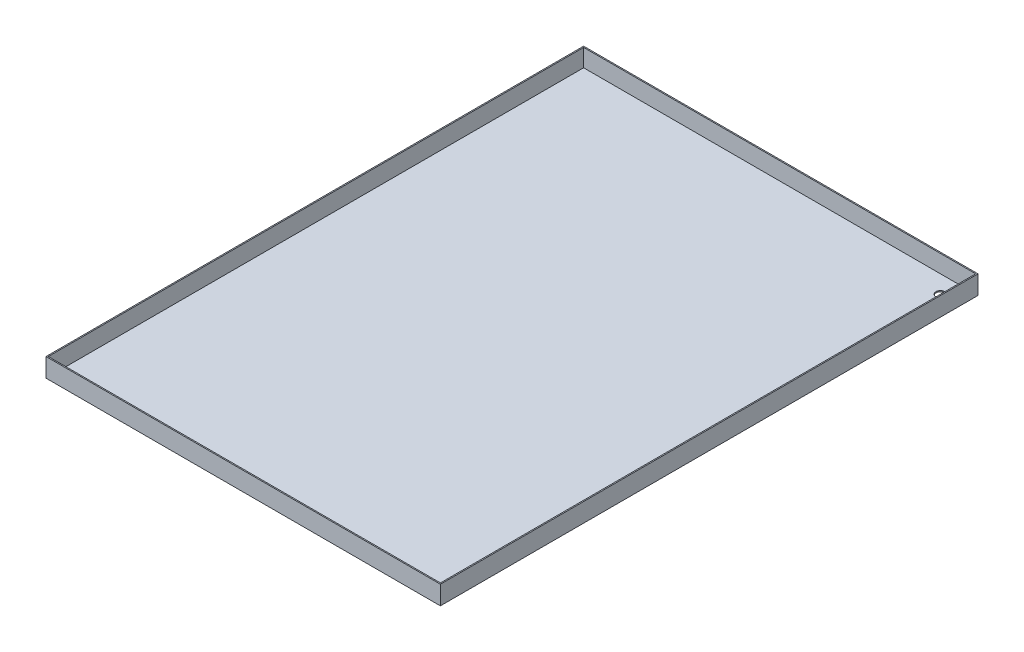
ISO-10303-21;
HEADER;
FILE_DESCRIPTION(('STEP AP214'),'2;1');
FILE_NAME('part.step','',(''),(''),'','','');
FILE_SCHEMA(('AUTOMOTIVE_DESIGN { 1 0 10303 214 1 1 1 1 }'));
ENDSEC;
DATA;
#1=APPLICATION_CONTEXT('core data for automotive mechanical design processes');
#2=APPLICATION_PROTOCOL_DEFINITION('international standard','automotive_design',2000,#1);
#3=PRODUCT_CONTEXT('',#1,'mechanical');
#4=PRODUCT('Part','Part','',(#3));
#5=PRODUCT_RELATED_PRODUCT_CATEGORY('part','',(#4));
#6=PRODUCT_DEFINITION_FORMATION('','',#4);
#7=PRODUCT_DEFINITION_CONTEXT('part definition',#1,'design');
#8=PRODUCT_DEFINITION('design','',#6,#7);
#9=PRODUCT_DEFINITION_SHAPE('','',#8);
#10=(LENGTH_UNIT() NAMED_UNIT(*) SI_UNIT(.MILLI.,.METRE.));
#11=(NAMED_UNIT(*) PLANE_ANGLE_UNIT() SI_UNIT($,.RADIAN.));
#12=(NAMED_UNIT(*) SI_UNIT($,.STERADIAN.) SOLID_ANGLE_UNIT());
#13=UNCERTAINTY_MEASURE_WITH_UNIT(LENGTH_MEASURE(1.E-05),#10,'distance_accuracy_value','');
#14=(GEOMETRIC_REPRESENTATION_CONTEXT(3) GLOBAL_UNCERTAINTY_ASSIGNED_CONTEXT((#13)) GLOBAL_UNIT_ASSIGNED_CONTEXT((#10,
#11,#12)) REPRESENTATION_CONTEXT('',''));
#15=CARTESIAN_POINT('',(0.,0.,0.));
#16=DIRECTION('',(0.,0.,1.));
#17=DIRECTION('',(1.,0.,0.));
#18=AXIS2_PLACEMENT_3D('',#15,#16,#17);
#19=CARTESIAN_POINT('',(0.,1.6,0.));
#20=DIRECTION('',(1.,0.,0.));
#21=DIRECTION('',(0.,0.,-1.));
#22=AXIS2_PLACEMENT_3D('',#19,#20,#21);
#23=PLANE('',#22);
#24=DIRECTION('',(0.,0.,1.));
#25=VECTOR('',#24,1.);
#26=CARTESIAN_POINT('',(0.,0.,0.));
#27=LINE('',#26,#25);
#28=CARTESIAN_POINT('',(0.,0.,-762.));
#29=VERTEX_POINT('',#28);
#30=CARTESIAN_POINT('',(0.,0.,0.));
#31=VERTEX_POINT('',#30);
#32=EDGE_CURVE('E150',#29,#31,#27,.T.);
#33=ORIENTED_EDGE('',*,*,#32,.T.);
#34=DIRECTION('',(0.,-1.,0.));
#35=VECTOR('',#34,1.);
#36=CARTESIAN_POINT('',(0.,1.6,0.));
#37=LINE('',#36,#35);
#38=CARTESIAN_POINT('',(0.,26.6,0.));
#39=VERTEX_POINT('',#38);
#40=EDGE_CURVE('E11',#39,#31,#37,.T.);
#41=ORIENTED_EDGE('',*,*,#40,.F.);
#42=DIRECTION('',(0.,0.,1.));
#43=VECTOR('',#42,1.);
#44=CARTESIAN_POINT('',(0.,26.6,0.));
#45=LINE('',#44,#43);
#46=CARTESIAN_POINT('',(0.,26.6,-762.));
#47=VERTEX_POINT('',#46);
#48=EDGE_CURVE('E144',#47,#39,#45,.T.);
#49=ORIENTED_EDGE('',*,*,#48,.F.);
#50=DIRECTION('',(0.,-1.,0.));
#51=VECTOR('',#50,1.);
#52=CARTESIAN_POINT('',(0.,1.6,-762.));
#53=LINE('',#52,#51);
#54=EDGE_CURVE('E158',#47,#29,#53,.T.);
#55=ORIENTED_EDGE('',*,*,#54,.T.);
#56=EDGE_LOOP('',(#33,#41,#49,#55));
#57=FACE_BOUND('',#56,.T.);
#58=ADVANCED_FACE('F31',(#57),#23,.F.);
#59=CARTESIAN_POINT('',(0.,1.6,0.));
#60=DIRECTION('',(0.,0.,-1.));
#61=DIRECTION('',(-1.,0.,0.));
#62=AXIS2_PLACEMENT_3D('',#59,#60,#61);
#63=PLANE('',#62);
#64=DIRECTION('',(1.,0.,0.));
#65=VECTOR('',#64,1.);
#66=CARTESIAN_POINT('',(0.,0.,0.));
#67=LINE('',#66,#65);
#68=CARTESIAN_POINT('',(559.,0.,0.));
#69=VERTEX_POINT('',#68);
#70=EDGE_CURVE('E153',#31,#69,#67,.T.);
#71=ORIENTED_EDGE('',*,*,#70,.T.);
#72=DIRECTION('',(0.,-1.,0.));
#73=VECTOR('',#72,1.);
#74=CARTESIAN_POINT('',(559.,1.6,0.));
#75=LINE('',#74,#73);
#76=CARTESIAN_POINT('',(559.,26.6,0.));
#77=VERTEX_POINT('',#76);
#78=EDGE_CURVE('E38',#77,#69,#75,.T.);
#79=ORIENTED_EDGE('',*,*,#78,.F.);
#80=DIRECTION('',(1.,0.,0.));
#81=VECTOR('',#80,1.);
#82=CARTESIAN_POINT('',(559.,26.6,0.));
#83=LINE('',#82,#81);
#84=EDGE_CURVE('E147',#39,#77,#83,.T.);
#85=ORIENTED_EDGE('',*,*,#84,.F.);
#86=ORIENTED_EDGE('',*,*,#40,.T.);
#87=EDGE_LOOP('',(#71,#79,#85,#86));
#88=FACE_BOUND('',#87,.T.);
#89=ADVANCED_FACE('F176',(#88),#63,.F.);
#90=CARTESIAN_POINT('',(559.,1.6,0.));
#91=DIRECTION('',(-1.,0.,0.));
#92=DIRECTION('',(0.,0.,1.));
#93=AXIS2_PLACEMENT_3D('',#90,#91,#92);
#94=PLANE('',#93);
#95=DIRECTION('',(0.,0.,-1.));
#96=VECTOR('',#95,1.);
#97=CARTESIAN_POINT('',(559.,0.,0.));
#98=LINE('',#97,#96);
#99=CARTESIAN_POINT('',(559.,0.,-762.));
#100=VERTEX_POINT('',#99);
#101=EDGE_CURVE('E155',#69,#100,#98,.T.);
#102=ORIENTED_EDGE('',*,*,#101,.T.);
#103=DIRECTION('',(0.,-1.,0.));
#104=VECTOR('',#103,1.);
#105=CARTESIAN_POINT('',(559.,1.6,-762.));
#106=LINE('',#105,#104);
#107=CARTESIAN_POINT('',(559.,26.6,-762.));
#108=VERTEX_POINT('',#107);
#109=EDGE_CURVE('E160',#108,#100,#106,.T.);
#110=ORIENTED_EDGE('',*,*,#109,.F.);
#111=DIRECTION('',(0.,0.,-1.));
#112=VECTOR('',#111,1.);
#113=CARTESIAN_POINT('',(559.,26.6,0.));
#114=LINE('',#113,#112);
#115=EDGE_CURVE('E113',#77,#108,#114,.T.);
#116=ORIENTED_EDGE('',*,*,#115,.F.);
#117=ORIENTED_EDGE('',*,*,#78,.T.);
#118=EDGE_LOOP('',(#102,#110,#116,#117));
#119=FACE_BOUND('',#118,.T.);
#120=ADVANCED_FACE('F165',(#119),#94,.F.);
#121=CARTESIAN_POINT('',(0.,1.6,-762.));
#122=DIRECTION('',(0.,0.,1.));
#123=DIRECTION('',(1.,0.,0.));
#124=AXIS2_PLACEMENT_3D('',#121,#122,#123);
#125=PLANE('',#124);
#126=DIRECTION('',(-1.,0.,0.));
#127=VECTOR('',#126,1.);
#128=CARTESIAN_POINT('',(0.,0.,-762.));
#129=LINE('',#128,#127);
#130=EDGE_CURVE('E53',#100,#29,#129,.T.);
#131=ORIENTED_EDGE('',*,*,#130,.T.);
#132=ORIENTED_EDGE('',*,*,#54,.F.);
#133=DIRECTION('',(-1.,0.,0.));
#134=VECTOR('',#133,1.);
#135=CARTESIAN_POINT('',(559.,26.6,-762.));
#136=LINE('',#135,#134);
#137=EDGE_CURVE('E141',#108,#47,#136,.T.);
#138=ORIENTED_EDGE('',*,*,#137,.F.);
#139=ORIENTED_EDGE('',*,*,#109,.T.);
#140=EDGE_LOOP('',(#131,#132,#138,#139));
#141=FACE_BOUND('',#140,.T.);
#142=ADVANCED_FACE('F174',(#141),#125,.F.);
#143=CARTESIAN_POINT('',(0.,0.,-762.));
#144=DIRECTION('',(0.,-1.,0.));
#145=DIRECTION('',(0.,0.,-1.));
#146=AXIS2_PLACEMENT_3D('',#143,#144,#145);
#147=PLANE('',#146);
#148=CARTESIAN_POINT('',(532.4,0.,-735.4));
#149=DIRECTION('',(0.,1.,0.));
#150=DIRECTION('',(0.,0.,1.));
#151=AXIS2_PLACEMENT_3D('',#148,#149,#150);
#152=CIRCLE('',#151,6.34999999999994);
#153=CARTESIAN_POINT('',(532.4,0.,-729.05));
#154=VERTEX_POINT('',#153);
#155=EDGE_CURVE('E128',#154,#154,#152,.T.);
#156=ORIENTED_EDGE('',*,*,#155,.T.);
#157=EDGE_LOOP('',(#156));
#158=FACE_BOUND('',#157,.T.);
#159=ORIENTED_EDGE('',*,*,#32,.F.);
#160=ORIENTED_EDGE('',*,*,#130,.F.);
#161=ORIENTED_EDGE('',*,*,#101,.F.);
#162=ORIENTED_EDGE('',*,*,#70,.F.);
#163=EDGE_LOOP('',(#159,#160,#161,#162));
#164=FACE_BOUND('',#163,.T.);
#165=ADVANCED_FACE('F170',(#158,#164),#147,.T.);
#166=CARTESIAN_POINT('',(559.,26.6,-762.));
#167=DIRECTION('',(0.,1.,0.));
#168=DIRECTION('',(0.,0.,1.));
#169=AXIS2_PLACEMENT_3D('',#166,#167,#168);
#170=PLANE('',#169);
#171=ORIENTED_EDGE('',*,*,#115,.T.);
#172=ORIENTED_EDGE('',*,*,#137,.T.);
#173=ORIENTED_EDGE('',*,*,#48,.T.);
#174=ORIENTED_EDGE('',*,*,#84,.T.);
#175=EDGE_LOOP('',(#171,#172,#173,#174));
#176=FACE_BOUND('',#175,.T.);
#177=DIRECTION('',(0.,0.,1.));
#178=VECTOR('',#177,1.);
#179=CARTESIAN_POINT('',(1.6,26.6,-760.4));
#180=LINE('',#179,#178);
#181=CARTESIAN_POINT('',(1.6,26.6,-760.4));
#182=VERTEX_POINT('',#181);
#183=CARTESIAN_POINT('',(1.6,26.6,-1.6));
#184=VERTEX_POINT('',#183);
#185=EDGE_CURVE('E105',#182,#184,#180,.T.);
#186=ORIENTED_EDGE('',*,*,#185,.F.);
#187=DIRECTION('',(-1.,0.,0.));
#188=VECTOR('',#187,1.);
#189=CARTESIAN_POINT('',(557.4,26.6,-760.4));
#190=LINE('',#189,#188);
#191=CARTESIAN_POINT('',(557.4,26.6,-760.4));
#192=VERTEX_POINT('',#191);
#193=EDGE_CURVE('E97',#192,#182,#190,.T.);
#194=ORIENTED_EDGE('',*,*,#193,.F.);
#195=DIRECTION('',(0.,0.,-1.));
#196=VECTOR('',#195,1.);
#197=CARTESIAN_POINT('',(557.4,26.6,-1.6));
#198=LINE('',#197,#196);
#199=CARTESIAN_POINT('',(557.4,26.6,-1.60000000000005));
#200=VERTEX_POINT('',#199);
#201=EDGE_CURVE('E121',#200,#192,#198,.T.);
#202=ORIENTED_EDGE('',*,*,#201,.F.);
#203=DIRECTION('',(1.,0.,0.));
#204=VECTOR('',#203,1.);
#205=CARTESIAN_POINT('',(1.6,26.6,-1.6));
#206=LINE('',#205,#204);
#207=EDGE_CURVE('E119',#184,#200,#206,.T.);
#208=ORIENTED_EDGE('',*,*,#207,.F.);
#209=EDGE_LOOP('',(#186,#194,#202,#208));
#210=FACE_BOUND('',#209,.T.);
#211=ADVANCED_FACE('F117',(#176,#210),#170,.T.);
#212=CARTESIAN_POINT('',(557.4,26.6,-760.4));
#213=DIRECTION('',(0.,0.,1.));
#214=DIRECTION('',(1.,0.,0.));
#215=AXIS2_PLACEMENT_3D('',#212,#213,#214);
#216=PLANE('',#215);
#217=DIRECTION('',(-1.,0.,0.));
#218=VECTOR('',#217,1.);
#219=CARTESIAN_POINT('',(557.4,1.6,-760.4));
#220=LINE('',#219,#218);
#221=CARTESIAN_POINT('',(557.4,1.6,-760.4));
#222=VERTEX_POINT('',#221);
#223=CARTESIAN_POINT('',(1.6,1.6,-760.4));
#224=VERTEX_POINT('',#223);
#225=EDGE_CURVE('E126',#222,#224,#220,.T.);
#226=ORIENTED_EDGE('',*,*,#225,.F.);
#227=DIRECTION('',(0.,-1.,0.));
#228=VECTOR('',#227,1.);
#229=CARTESIAN_POINT('',(557.4,26.6,-760.4));
#230=LINE('',#229,#228);
#231=EDGE_CURVE('E45',#192,#222,#230,.T.);
#232=ORIENTED_EDGE('',*,*,#231,.F.);
#233=ORIENTED_EDGE('',*,*,#193,.T.);
#234=DIRECTION('',(0.,-1.,0.));
#235=VECTOR('',#234,1.);
#236=CARTESIAN_POINT('',(1.6,26.6,-760.4));
#237=LINE('',#236,#235);
#238=EDGE_CURVE('E100',#182,#224,#237,.T.);
#239=ORIENTED_EDGE('',*,*,#238,.T.);
#240=EDGE_LOOP('',(#226,#232,#233,#239));
#241=FACE_BOUND('',#240,.T.);
#242=ADVANCED_FACE('F99',(#241),#216,.T.);
#243=CARTESIAN_POINT('',(1.6,26.6,-760.4));
#244=DIRECTION('',(1.,0.,0.));
#245=DIRECTION('',(0.,0.,-1.));
#246=AXIS2_PLACEMENT_3D('',#243,#244,#245);
#247=PLANE('',#246);
#248=DIRECTION('',(0.,0.,1.));
#249=VECTOR('',#248,1.);
#250=CARTESIAN_POINT('',(1.6,1.6,-760.4));
#251=LINE('',#250,#249);
#252=CARTESIAN_POINT('',(1.6,1.6,-1.6));
#253=VERTEX_POINT('',#252);
#254=EDGE_CURVE('E112',#224,#253,#251,.T.);
#255=ORIENTED_EDGE('',*,*,#254,.F.);
#256=ORIENTED_EDGE('',*,*,#238,.F.);
#257=ORIENTED_EDGE('',*,*,#185,.T.);
#258=DIRECTION('',(0.,-1.,0.));
#259=VECTOR('',#258,1.);
#260=CARTESIAN_POINT('',(1.6,26.6,-1.6));
#261=LINE('',#260,#259);
#262=EDGE_CURVE('E114',#184,#253,#261,.T.);
#263=ORIENTED_EDGE('',*,*,#262,.T.);
#264=EDGE_LOOP('',(#255,#256,#257,#263));
#265=FACE_BOUND('',#264,.T.);
#266=ADVANCED_FACE('F109',(#265),#247,.T.);
#267=CARTESIAN_POINT('',(1.6,26.6,-1.6));
#268=DIRECTION('',(0.,0.,-1.));
#269=DIRECTION('',(-1.,0.,0.));
#270=AXIS2_PLACEMENT_3D('',#267,#268,#269);
#271=PLANE('',#270);
#272=DIRECTION('',(1.,0.,0.));
#273=VECTOR('',#272,1.);
#274=CARTESIAN_POINT('',(1.6,1.6,-1.6));
#275=LINE('',#274,#273);
#276=CARTESIAN_POINT('',(557.4,1.6,-1.6));
#277=VERTEX_POINT('',#276);
#278=EDGE_CURVE('E130',#253,#277,#275,.T.);
#279=ORIENTED_EDGE('',*,*,#278,.F.);
#280=ORIENTED_EDGE('',*,*,#262,.F.);
#281=ORIENTED_EDGE('',*,*,#207,.T.);
#282=DIRECTION('',(0.,-1.,0.));
#283=VECTOR('',#282,1.);
#284=CARTESIAN_POINT('',(557.4,26.6,-1.6));
#285=LINE('',#284,#283);
#286=EDGE_CURVE('E136',#200,#277,#285,.T.);
#287=ORIENTED_EDGE('',*,*,#286,.T.);
#288=EDGE_LOOP('',(#279,#280,#281,#287));
#289=FACE_BOUND('',#288,.T.);
#290=ADVANCED_FACE('F201',(#289),#271,.T.);
#291=CARTESIAN_POINT('',(557.4,26.6,-1.6));
#292=DIRECTION('',(-1.,0.,0.));
#293=DIRECTION('',(0.,0.,1.));
#294=AXIS2_PLACEMENT_3D('',#291,#292,#293);
#295=PLANE('',#294);
#296=DIRECTION('',(0.,0.,-1.));
#297=VECTOR('',#296,1.);
#298=CARTESIAN_POINT('',(557.4,1.6,-1.6));
#299=LINE('',#298,#297);
#300=EDGE_CURVE('E106',#277,#222,#299,.T.);
#301=ORIENTED_EDGE('',*,*,#300,.F.);
#302=ORIENTED_EDGE('',*,*,#286,.F.);
#303=ORIENTED_EDGE('',*,*,#201,.T.);
#304=ORIENTED_EDGE('',*,*,#231,.T.);
#305=EDGE_LOOP('',(#301,#302,#303,#304));
#306=FACE_BOUND('',#305,.T.);
#307=ADVANCED_FACE('F193',(#306),#295,.T.);
#308=CARTESIAN_POINT('',(0.,1.6,-762.));
#309=DIRECTION('',(0.,-1.,0.));
#310=DIRECTION('',(0.,0.,-1.));
#311=AXIS2_PLACEMENT_3D('',#308,#309,#310);
#312=PLANE('',#311);
#313=CARTESIAN_POINT('',(532.4,1.6,-735.4));
#314=DIRECTION('',(0.,1.,0.));
#315=DIRECTION('',(0.,0.,1.));
#316=AXIS2_PLACEMENT_3D('',#313,#314,#315);
#317=CIRCLE('',#316,6.34999999999994);
#318=CARTESIAN_POINT('',(532.4,1.6,-729.05));
#319=VERTEX_POINT('',#318);
#320=EDGE_CURVE('E217',#319,#319,#317,.T.);
#321=ORIENTED_EDGE('',*,*,#320,.F.);
#322=EDGE_LOOP('',(#321));
#323=FACE_BOUND('',#322,.T.);
#324=ORIENTED_EDGE('',*,*,#300,.T.);
#325=ORIENTED_EDGE('',*,*,#225,.T.);
#326=ORIENTED_EDGE('',*,*,#254,.T.);
#327=ORIENTED_EDGE('',*,*,#278,.T.);
#328=EDGE_LOOP('',(#324,#325,#326,#327));
#329=FACE_BOUND('',#328,.T.);
#330=ADVANCED_FACE('F189',(#323,#329),#312,.F.);
#331=CARTESIAN_POINT('',(532.4,0.,-735.4));
#332=DIRECTION('',(0.,1.,0.));
#333=DIRECTION('',(0.,0.,1.));
#334=AXIS2_PLACEMENT_3D('',#331,#332,#333);
#335=CYLINDRICAL_SURFACE('',#334,6.34999999999994);
#336=ORIENTED_EDGE('',*,*,#155,.F.);
#337=EDGE_LOOP('',(#336));
#338=FACE_BOUND('',#337,.T.);
#339=ORIENTED_EDGE('',*,*,#320,.T.);
#340=EDGE_LOOP('',(#339));
#341=FACE_BOUND('',#340,.T.);
#342=ADVANCED_FACE('F192',(#338,#341),#335,.F.);
#343=CLOSED_SHELL('',(#58,#89,#120,#142,#165,#211,#242,#266,#290,#307,#330,#342));
#344=MANIFOLD_SOLID_BREP('B2',#343);
#345=ADVANCED_BREP_SHAPE_REPRESENTATION('',(#18,#344),#14);
#346=SHAPE_DEFINITION_REPRESENTATION(#9,#345);
ENDSEC;
END-ISO-10303-21;
